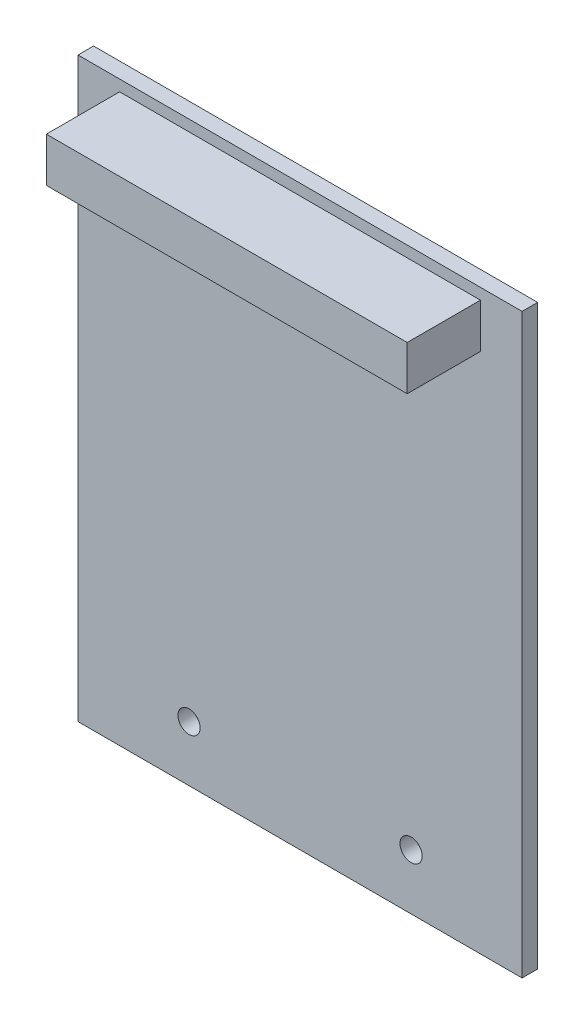
ISO-10303-21;
HEADER;
FILE_DESCRIPTION(('STEP AP214'),'2;1');
FILE_NAME('part.step','',(''),(''),'','','');
FILE_SCHEMA(('AUTOMOTIVE_DESIGN { 1 0 10303 214 1 1 1 1 }'));
ENDSEC;
DATA;
#1=APPLICATION_CONTEXT('core data for automotive mechanical design processes');
#2=APPLICATION_PROTOCOL_DEFINITION('international standard','automotive_design',2000,#1);
#3=PRODUCT_CONTEXT('',#1,'mechanical');
#4=PRODUCT('Part','Part','',(#3));
#5=PRODUCT_RELATED_PRODUCT_CATEGORY('part','',(#4));
#6=PRODUCT_DEFINITION_FORMATION('','',#4);
#7=PRODUCT_DEFINITION_CONTEXT('part definition',#1,'design');
#8=PRODUCT_DEFINITION('design','',#6,#7);
#9=PRODUCT_DEFINITION_SHAPE('','',#8);
#10=(LENGTH_UNIT() NAMED_UNIT(*) SI_UNIT(.MILLI.,.METRE.));
#11=(NAMED_UNIT(*) PLANE_ANGLE_UNIT() SI_UNIT($,.RADIAN.));
#12=(NAMED_UNIT(*) SI_UNIT($,.STERADIAN.) SOLID_ANGLE_UNIT());
#13=UNCERTAINTY_MEASURE_WITH_UNIT(LENGTH_MEASURE(1.E-05),#10,'distance_accuracy_value','');
#14=(GEOMETRIC_REPRESENTATION_CONTEXT(3) GLOBAL_UNCERTAINTY_ASSIGNED_CONTEXT((#13)) GLOBAL_UNIT_ASSIGNED_CONTEXT((#10,
#11,#12)) REPRESENTATION_CONTEXT('',''));
#15=CARTESIAN_POINT('',(0.,0.,0.));
#16=DIRECTION('',(0.,0.,1.));
#17=DIRECTION('',(1.,0.,0.));
#18=AXIS2_PLACEMENT_3D('',#15,#16,#17);
#19=CARTESIAN_POINT('',(0.,0.,1.778));
#20=DIRECTION('',(0.,0.,1.));
#21=DIRECTION('',(1.,0.,0.));
#22=AXIS2_PLACEMENT_3D('',#19,#20,#21);
#23=PLANE('',#22);
#24=CARTESIAN_POINT('',(12.7,6.35000000000001,1.778));
#25=DIRECTION('',(0.,0.,1.));
#26=DIRECTION('',(1.,0.,0.));
#27=AXIS2_PLACEMENT_3D('',#24,#25,#26);
#28=CIRCLE('',#27,1.27);
#29=CARTESIAN_POINT('',(13.97,6.35000000000001,1.778));
#30=VERTEX_POINT('',#29);
#31=EDGE_CURVE('E212',#30,#30,#28,.T.);
#32=ORIENTED_EDGE('',*,*,#31,.F.);
#33=EDGE_LOOP('',(#32));
#34=FACE_BOUND('',#33,.T.);
#35=CARTESIAN_POINT('',(38.1,6.35000000000001,1.778));
#36=DIRECTION('',(0.,0.,1.));
#37=DIRECTION('',(1.,0.,0.));
#38=AXIS2_PLACEMENT_3D('',#35,#36,#37);
#39=CIRCLE('',#38,1.27);
#40=CARTESIAN_POINT('',(39.37,6.35000000000001,1.778));
#41=VERTEX_POINT('',#40);
#42=EDGE_CURVE('E217',#41,#41,#39,.T.);
#43=ORIENTED_EDGE('',*,*,#42,.F.);
#44=EDGE_LOOP('',(#43));
#45=FACE_BOUND('',#44,.T.);
#46=DIRECTION('',(0.,-1.,0.));
#47=VECTOR('',#46,1.);
#48=CARTESIAN_POINT('',(0.,66.04,1.778));
#49=LINE('',#48,#47);
#50=CARTESIAN_POINT('',(0.,66.04,1.778));
#51=VERTEX_POINT('',#50);
#52=CARTESIAN_POINT('',(0.,0.,1.778));
#53=VERTEX_POINT('',#52);
#54=EDGE_CURVE('E140',#51,#53,#49,.T.);
#55=ORIENTED_EDGE('',*,*,#54,.T.);
#56=DIRECTION('',(1.,0.,0.));
#57=VECTOR('',#56,1.);
#58=CARTESIAN_POINT('',(0.,0.,1.778));
#59=LINE('',#58,#57);
#60=CARTESIAN_POINT('',(50.8,0.,1.778));
#61=VERTEX_POINT('',#60);
#62=EDGE_CURVE('E85',#53,#61,#59,.T.);
#63=ORIENTED_EDGE('',*,*,#62,.T.);
#64=DIRECTION('',(0.,1.,0.));
#65=VECTOR('',#64,1.);
#66=CARTESIAN_POINT('',(50.8,66.04,1.778));
#67=LINE('',#66,#65);
#68=CARTESIAN_POINT('',(50.8,66.04,1.778));
#69=VERTEX_POINT('',#68);
#70=EDGE_CURVE('E143',#61,#69,#67,.T.);
#71=ORIENTED_EDGE('',*,*,#70,.T.);
#72=DIRECTION('',(-1.,0.,0.));
#73=VECTOR('',#72,1.);
#74=CARTESIAN_POINT('',(0.,66.04,1.778));
#75=LINE('',#74,#73);
#76=EDGE_CURVE('E57',#69,#51,#75,.T.);
#77=ORIENTED_EDGE('',*,*,#76,.T.);
#78=EDGE_LOOP('',(#55,#63,#71,#77));
#79=FACE_BOUND('',#78,.T.);
#80=DIRECTION('',(1.,0.,0.));
#81=VECTOR('',#80,1.);
#82=CARTESIAN_POINT('',(4.76250000000001,59.69,1.778));
#83=LINE('',#82,#81);
#84=CARTESIAN_POINT('',(4.76250000000001,59.69,1.778));
#85=VERTEX_POINT('',#84);
#86=CARTESIAN_POINT('',(46.0375,59.69,1.778));
#87=VERTEX_POINT('',#86);
#88=EDGE_CURVE('E226',#85,#87,#83,.T.);
#89=ORIENTED_EDGE('',*,*,#88,.F.);
#90=DIRECTION('',(0.,-1.,0.));
#91=VECTOR('',#90,1.);
#92=CARTESIAN_POINT('',(4.76250000000001,64.77,1.778));
#93=LINE('',#92,#91);
#94=CARTESIAN_POINT('',(4.76250000000001,64.77,1.778));
#95=VERTEX_POINT('',#94);
#96=EDGE_CURVE('E130',#95,#85,#93,.T.);
#97=ORIENTED_EDGE('',*,*,#96,.F.);
#98=DIRECTION('',(-1.,0.,0.));
#99=VECTOR('',#98,1.);
#100=CARTESIAN_POINT('',(4.76250000000001,64.77,1.778));
#101=LINE('',#100,#99);
#102=CARTESIAN_POINT('',(46.0375,64.77,1.778));
#103=VERTEX_POINT('',#102);
#104=EDGE_CURVE('E126',#103,#95,#101,.T.);
#105=ORIENTED_EDGE('',*,*,#104,.F.);
#106=DIRECTION('',(0.,1.,0.));
#107=VECTOR('',#106,1.);
#108=CARTESIAN_POINT('',(46.0375,64.77,1.778));
#109=LINE('',#108,#107);
#110=EDGE_CURVE('E228',#87,#103,#109,.T.);
#111=ORIENTED_EDGE('',*,*,#110,.F.);
#112=EDGE_LOOP('',(#89,#97,#105,#111));
#113=FACE_BOUND('',#112,.T.);
#114=ADVANCED_FACE('F33',(#34,#45,#79,#113),#23,.T.);
#115=CARTESIAN_POINT('',(0.,66.04,1.778));
#116=DIRECTION('',(1.,0.,0.));
#117=DIRECTION('',(0.,1.,0.));
#118=AXIS2_PLACEMENT_3D('',#115,#116,#117);
#119=PLANE('',#118);
#120=DIRECTION('',(0.,-1.,0.));
#121=VECTOR('',#120,1.);
#122=CARTESIAN_POINT('',(0.,66.04,0.));
#123=LINE('',#122,#121);
#124=CARTESIAN_POINT('',(0.,66.04,0.));
#125=VERTEX_POINT('',#124);
#126=CARTESIAN_POINT('',(0.,0.,0.));
#127=VERTEX_POINT('',#126);
#128=EDGE_CURVE('E132',#125,#127,#123,.T.);
#129=ORIENTED_EDGE('',*,*,#128,.T.);
#130=DIRECTION('',(0.,0.,-1.));
#131=VECTOR('',#130,1.);
#132=CARTESIAN_POINT('',(0.,0.,1.778));
#133=LINE('',#132,#131);
#134=EDGE_CURVE('E11',#53,#127,#133,.T.);
#135=ORIENTED_EDGE('',*,*,#134,.F.);
#136=ORIENTED_EDGE('',*,*,#54,.F.);
#137=DIRECTION('',(0.,0.,-1.));
#138=VECTOR('',#137,1.);
#139=CARTESIAN_POINT('',(0.,66.04,1.778));
#140=LINE('',#139,#138);
#141=EDGE_CURVE('E145',#51,#125,#140,.T.);
#142=ORIENTED_EDGE('',*,*,#141,.T.);
#143=EDGE_LOOP('',(#129,#135,#136,#142));
#144=FACE_BOUND('',#143,.T.);
#145=ADVANCED_FACE('F35',(#144),#119,.F.);
#146=CARTESIAN_POINT('',(0.,0.,1.778));
#147=DIRECTION('',(0.,1.,0.));
#148=DIRECTION('',(-1.,0.,0.));
#149=AXIS2_PLACEMENT_3D('',#146,#147,#148);
#150=PLANE('',#149);
#151=DIRECTION('',(1.,0.,0.));
#152=VECTOR('',#151,1.);
#153=CARTESIAN_POINT('',(0.,0.,0.));
#154=LINE('',#153,#152);
#155=CARTESIAN_POINT('',(50.8,0.,0.));
#156=VERTEX_POINT('',#155);
#157=EDGE_CURVE('E135',#127,#156,#154,.T.);
#158=ORIENTED_EDGE('',*,*,#157,.T.);
#159=DIRECTION('',(0.,0.,-1.));
#160=VECTOR('',#159,1.);
#161=CARTESIAN_POINT('',(50.8,0.,1.778));
#162=LINE('',#161,#160);
#163=EDGE_CURVE('E41',#61,#156,#162,.T.);
#164=ORIENTED_EDGE('',*,*,#163,.F.);
#165=ORIENTED_EDGE('',*,*,#62,.F.);
#166=ORIENTED_EDGE('',*,*,#134,.T.);
#167=EDGE_LOOP('',(#158,#164,#165,#166));
#168=FACE_BOUND('',#167,.T.);
#169=ADVANCED_FACE('F174',(#168),#150,.F.);
#170=CARTESIAN_POINT('',(50.8,66.04,1.778));
#171=DIRECTION('',(-1.,0.,0.));
#172=DIRECTION('',(0.,0.,1.));
#173=AXIS2_PLACEMENT_3D('',#170,#171,#172);
#174=PLANE('',#173);
#175=DIRECTION('',(0.,1.,0.));
#176=VECTOR('',#175,1.);
#177=CARTESIAN_POINT('',(50.8,66.04,0.));
#178=LINE('',#177,#176);
#179=CARTESIAN_POINT('',(50.8,66.04,0.));
#180=VERTEX_POINT('',#179);
#181=EDGE_CURVE('E148',#156,#180,#178,.T.);
#182=ORIENTED_EDGE('',*,*,#181,.T.);
#183=DIRECTION('',(0.,0.,-1.));
#184=VECTOR('',#183,1.);
#185=CARTESIAN_POINT('',(50.8,66.04,1.778));
#186=LINE('',#185,#184);
#187=EDGE_CURVE('E152',#69,#180,#186,.T.);
#188=ORIENTED_EDGE('',*,*,#187,.F.);
#189=ORIENTED_EDGE('',*,*,#70,.F.);
#190=ORIENTED_EDGE('',*,*,#163,.T.);
#191=EDGE_LOOP('',(#182,#188,#189,#190));
#192=FACE_BOUND('',#191,.T.);
#193=ADVANCED_FACE('F157',(#192),#174,.F.);
#194=CARTESIAN_POINT('',(0.,66.04,1.778));
#195=DIRECTION('',(0.,-1.,0.));
#196=DIRECTION('',(1.,0.,0.));
#197=AXIS2_PLACEMENT_3D('',#194,#195,#196);
#198=PLANE('',#197);
#199=DIRECTION('',(-1.,0.,0.));
#200=VECTOR('',#199,1.);
#201=CARTESIAN_POINT('',(0.,66.04,0.));
#202=LINE('',#201,#200);
#203=EDGE_CURVE('E78',#180,#125,#202,.T.);
#204=ORIENTED_EDGE('',*,*,#203,.T.);
#205=ORIENTED_EDGE('',*,*,#141,.F.);
#206=ORIENTED_EDGE('',*,*,#76,.F.);
#207=ORIENTED_EDGE('',*,*,#187,.T.);
#208=EDGE_LOOP('',(#204,#205,#206,#207));
#209=FACE_BOUND('',#208,.T.);
#210=ADVANCED_FACE('F165',(#209),#198,.F.);
#211=CARTESIAN_POINT('',(0.,0.,0.));
#212=DIRECTION('',(0.,0.,1.));
#213=DIRECTION('',(1.,0.,0.));
#214=AXIS2_PLACEMENT_3D('',#211,#212,#213);
#215=PLANE('',#214);
#216=CARTESIAN_POINT('',(12.7,6.35000000000001,0.));
#217=DIRECTION('',(0.,0.,1.));
#218=DIRECTION('',(1.,0.,0.));
#219=AXIS2_PLACEMENT_3D('',#216,#217,#218);
#220=CIRCLE('',#219,1.27);
#221=CARTESIAN_POINT('',(13.97,6.35000000000001,0.));
#222=VERTEX_POINT('',#221);
#223=EDGE_CURVE('E210',#222,#222,#220,.F.);
#224=ORIENTED_EDGE('',*,*,#223,.F.);
#225=EDGE_LOOP('',(#224));
#226=FACE_BOUND('',#225,.T.);
#227=CARTESIAN_POINT('',(38.1,6.35000000000001,0.));
#228=DIRECTION('',(0.,0.,1.));
#229=DIRECTION('',(1.,0.,0.));
#230=AXIS2_PLACEMENT_3D('',#227,#228,#229);
#231=CIRCLE('',#230,1.27);
#232=CARTESIAN_POINT('',(39.37,6.35000000000001,0.));
#233=VERTEX_POINT('',#232);
#234=EDGE_CURVE('E213',#233,#233,#231,.F.);
#235=ORIENTED_EDGE('',*,*,#234,.F.);
#236=EDGE_LOOP('',(#235));
#237=FACE_BOUND('',#236,.T.);
#238=ORIENTED_EDGE('',*,*,#128,.F.);
#239=ORIENTED_EDGE('',*,*,#203,.F.);
#240=ORIENTED_EDGE('',*,*,#181,.F.);
#241=ORIENTED_EDGE('',*,*,#157,.F.);
#242=EDGE_LOOP('',(#238,#239,#240,#241));
#243=FACE_BOUND('',#242,.T.);
#244=ADVANCED_FACE('F161',(#226,#237,#243),#215,.F.);
#245=CARTESIAN_POINT('',(4.76250000000001,64.77,10.16));
#246=DIRECTION('',(1.,0.,0.));
#247=DIRECTION('',(0.,0.,-1.));
#248=AXIS2_PLACEMENT_3D('',#245,#246,#247);
#249=PLANE('',#248);
#250=ORIENTED_EDGE('',*,*,#96,.T.);
#251=DIRECTION('',(0.,0.,-1.));
#252=VECTOR('',#251,1.);
#253=CARTESIAN_POINT('',(4.76250000000001,59.69,10.16));
#254=LINE('',#253,#252);
#255=CARTESIAN_POINT('',(4.76250000000001,59.69,10.16));
#256=VERTEX_POINT('',#255);
#257=EDGE_CURVE('E111',#256,#85,#254,.T.);
#258=ORIENTED_EDGE('',*,*,#257,.F.);
#259=DIRECTION('',(0.,-1.,0.));
#260=VECTOR('',#259,1.);
#261=CARTESIAN_POINT('',(4.76250000000001,64.77,10.16));
#262=LINE('',#261,#260);
#263=CARTESIAN_POINT('',(4.76250000000001,64.77,10.16));
#264=VERTEX_POINT('',#263);
#265=EDGE_CURVE('E118',#264,#256,#262,.T.);
#266=ORIENTED_EDGE('',*,*,#265,.F.);
#267=DIRECTION('',(0.,0.,-1.));
#268=VECTOR('',#267,1.);
#269=CARTESIAN_POINT('',(4.76250000000001,64.77,10.16));
#270=LINE('',#269,#268);
#271=EDGE_CURVE('E224',#264,#95,#270,.T.);
#272=ORIENTED_EDGE('',*,*,#271,.T.);
#273=EDGE_LOOP('',(#250,#258,#266,#272));
#274=FACE_BOUND('',#273,.T.);
#275=ADVANCED_FACE('F128',(#274),#249,.F.);
#276=CARTESIAN_POINT('',(4.76250000000001,59.69,10.16));
#277=DIRECTION('',(0.,1.,0.));
#278=DIRECTION('',(0.,0.,1.));
#279=AXIS2_PLACEMENT_3D('',#276,#277,#278);
#280=PLANE('',#279);
#281=ORIENTED_EDGE('',*,*,#88,.T.);
#282=DIRECTION('',(0.,0.,-1.));
#283=VECTOR('',#282,1.);
#284=CARTESIAN_POINT('',(46.0375,59.69,10.16));
#285=LINE('',#284,#283);
#286=CARTESIAN_POINT('',(46.0375,59.69,10.16));
#287=VERTEX_POINT('',#286);
#288=EDGE_CURVE('E114',#287,#87,#285,.T.);
#289=ORIENTED_EDGE('',*,*,#288,.F.);
#290=DIRECTION('',(1.,0.,0.));
#291=VECTOR('',#290,1.);
#292=CARTESIAN_POINT('',(4.76250000000001,59.69,10.16));
#293=LINE('',#292,#291);
#294=EDGE_CURVE('E107',#256,#287,#293,.T.);
#295=ORIENTED_EDGE('',*,*,#294,.F.);
#296=ORIENTED_EDGE('',*,*,#257,.T.);
#297=EDGE_LOOP('',(#281,#289,#295,#296));
#298=FACE_BOUND('',#297,.T.);
#299=ADVANCED_FACE('F109',(#298),#280,.F.);
#300=CARTESIAN_POINT('',(46.0375,64.77,10.16));
#301=DIRECTION('',(-1.,0.,0.));
#302=DIRECTION('',(0.,0.,1.));
#303=AXIS2_PLACEMENT_3D('',#300,#301,#302);
#304=PLANE('',#303);
#305=ORIENTED_EDGE('',*,*,#110,.T.);
#306=DIRECTION('',(0.,0.,-1.));
#307=VECTOR('',#306,1.);
#308=CARTESIAN_POINT('',(46.0375,64.77,10.16));
#309=LINE('',#308,#307);
#310=CARTESIAN_POINT('',(46.0375,64.77,10.16));
#311=VERTEX_POINT('',#310);
#312=EDGE_CURVE('E48',#311,#103,#309,.T.);
#313=ORIENTED_EDGE('',*,*,#312,.F.);
#314=DIRECTION('',(0.,1.,0.));
#315=VECTOR('',#314,1.);
#316=CARTESIAN_POINT('',(46.0375,64.77,10.16));
#317=LINE('',#316,#315);
#318=EDGE_CURVE('E117',#287,#311,#317,.T.);
#319=ORIENTED_EDGE('',*,*,#318,.F.);
#320=ORIENTED_EDGE('',*,*,#288,.T.);
#321=EDGE_LOOP('',(#305,#313,#319,#320));
#322=FACE_BOUND('',#321,.T.);
#323=ADVANCED_FACE('F189',(#322),#304,.F.);
#324=CARTESIAN_POINT('',(4.76250000000001,64.77,10.16));
#325=DIRECTION('',(0.,-1.,0.));
#326=DIRECTION('',(1.,0.,0.));
#327=AXIS2_PLACEMENT_3D('',#324,#325,#326);
#328=PLANE('',#327);
#329=ORIENTED_EDGE('',*,*,#104,.T.);
#330=ORIENTED_EDGE('',*,*,#271,.F.);
#331=DIRECTION('',(-1.,0.,0.));
#332=VECTOR('',#331,1.);
#333=CARTESIAN_POINT('',(4.76250000000001,64.77,10.16));
#334=LINE('',#333,#332);
#335=EDGE_CURVE('E122',#311,#264,#334,.T.);
#336=ORIENTED_EDGE('',*,*,#335,.F.);
#337=ORIENTED_EDGE('',*,*,#312,.T.);
#338=EDGE_LOOP('',(#329,#330,#336,#337));
#339=FACE_BOUND('',#338,.T.);
#340=ADVANCED_FACE('F192',(#339),#328,.F.);
#341=CARTESIAN_POINT('',(0.,0.,10.16));
#342=DIRECTION('',(0.,0.,1.));
#343=DIRECTION('',(1.,0.,0.));
#344=AXIS2_PLACEMENT_3D('',#341,#342,#343);
#345=PLANE('',#344);
#346=ORIENTED_EDGE('',*,*,#265,.T.);
#347=ORIENTED_EDGE('',*,*,#294,.T.);
#348=ORIENTED_EDGE('',*,*,#318,.T.);
#349=ORIENTED_EDGE('',*,*,#335,.T.);
#350=EDGE_LOOP('',(#346,#347,#348,#349));
#351=FACE_BOUND('',#350,.T.);
#352=ADVANCED_FACE('F121',(#351),#345,.T.);
#353=CARTESIAN_POINT('',(38.1,6.35000000000001,-3.59210244842766));
#354=DIRECTION('',(0.,0.,1.));
#355=DIRECTION('',(1.,0.,0.));
#356=AXIS2_PLACEMENT_3D('',#353,#354,#355);
#357=CYLINDRICAL_SURFACE('',#356,1.27);
#358=ORIENTED_EDGE('',*,*,#234,.T.);
#359=EDGE_LOOP('',(#358));
#360=FACE_BOUND('',#359,.T.);
#361=ORIENTED_EDGE('',*,*,#42,.T.);
#362=EDGE_LOOP('',(#361));
#363=FACE_BOUND('',#362,.T.);
#364=ADVANCED_FACE('F198',(#360,#363),#357,.F.);
#365=CARTESIAN_POINT('',(12.7,6.35000000000001,-3.59210244842766));
#366=DIRECTION('',(0.,0.,1.));
#367=DIRECTION('',(1.,0.,0.));
#368=AXIS2_PLACEMENT_3D('',#365,#366,#367);
#369=CYLINDRICAL_SURFACE('',#368,1.27);
#370=ORIENTED_EDGE('',*,*,#223,.T.);
#371=EDGE_LOOP('',(#370));
#372=FACE_BOUND('',#371,.T.);
#373=ORIENTED_EDGE('',*,*,#31,.T.);
#374=EDGE_LOOP('',(#373));
#375=FACE_BOUND('',#374,.T.);
#376=ADVANCED_FACE('F201',(#372,#375),#369,.F.);
#377=CLOSED_SHELL('',(#114,#145,#169,#193,#210,#244,#275,#299,#323,#340,#352,#364,#376));
#378=MANIFOLD_SOLID_BREP('B2',#377);
#379=ADVANCED_BREP_SHAPE_REPRESENTATION('',(#18,#378),#14);
#380=SHAPE_DEFINITION_REPRESENTATION(#9,#379);
ENDSEC;
END-ISO-10303-21;
